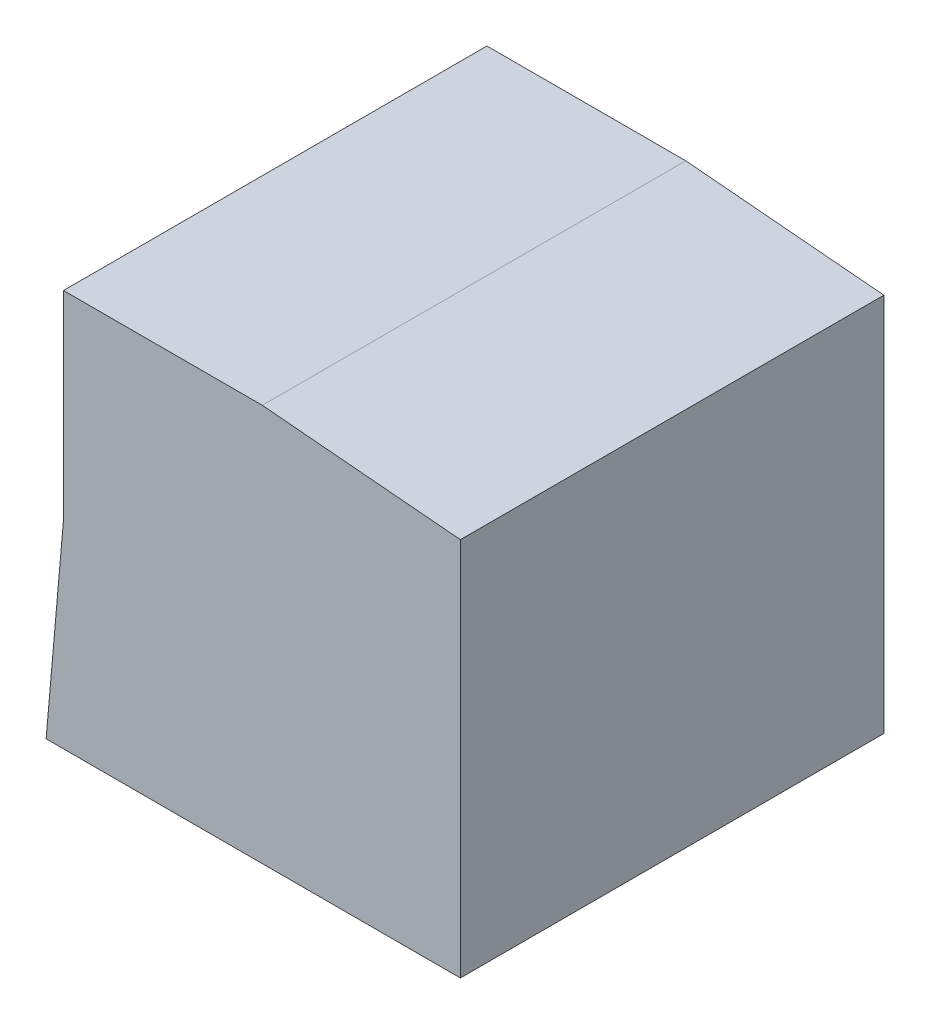
ISO-10303-21;
HEADER;
FILE_DESCRIPTION(('STEP AP214'),'2;1');
FILE_NAME('part.step','',(''),(''),'','','');
FILE_SCHEMA(('AUTOMOTIVE_DESIGN { 1 0 10303 214 1 1 1 1 }'));
ENDSEC;
DATA;
#1=APPLICATION_CONTEXT('core data for automotive mechanical design processes');
#2=APPLICATION_PROTOCOL_DEFINITION('international standard','automotive_design',2000,#1);
#3=PRODUCT_CONTEXT('',#1,'mechanical');
#4=PRODUCT('Part','Part','',(#3));
#5=PRODUCT_RELATED_PRODUCT_CATEGORY('part','',(#4));
#6=PRODUCT_DEFINITION_FORMATION('','',#4);
#7=PRODUCT_DEFINITION_CONTEXT('part definition',#1,'design');
#8=PRODUCT_DEFINITION('design','',#6,#7);
#9=PRODUCT_DEFINITION_SHAPE('','',#8);
#10=(LENGTH_UNIT() NAMED_UNIT(*) SI_UNIT(.MILLI.,.METRE.));
#11=(NAMED_UNIT(*) PLANE_ANGLE_UNIT() SI_UNIT($,.RADIAN.));
#12=(NAMED_UNIT(*) SI_UNIT($,.STERADIAN.) SOLID_ANGLE_UNIT());
#13=UNCERTAINTY_MEASURE_WITH_UNIT(LENGTH_MEASURE(1.E-05),#10,'distance_accuracy_value','');
#14=(GEOMETRIC_REPRESENTATION_CONTEXT(3) GLOBAL_UNCERTAINTY_ASSIGNED_CONTEXT((#13)) GLOBAL_UNIT_ASSIGNED_CONTEXT((#10,
#11,#12)) REPRESENTATION_CONTEXT('',''));
#15=CARTESIAN_POINT('',(0.,0.,0.));
#16=DIRECTION('',(0.,0.,1.));
#17=DIRECTION('',(1.,0.,0.));
#18=AXIS2_PLACEMENT_3D('',#15,#16,#17);
#19=CARTESIAN_POINT('',(0.,0.,40.));
#20=DIRECTION('',(1.,0.,0.));
#21=DIRECTION('',(0.,0.,-1.));
#22=AXIS2_PLACEMENT_3D('',#19,#20,#21);
#23=PLANE('',#22);
#24=DIRECTION('',(0.,-1.,0.));
#25=VECTOR('',#24,1.);
#26=CARTESIAN_POINT('',(0.,0.,0.));
#27=LINE('',#26,#25);
#28=CARTESIAN_POINT('',(0.,0.,0.));
#29=VERTEX_POINT('',#28);
#30=CARTESIAN_POINT('',(0.,-18.7818459466086,0.));
#31=VERTEX_POINT('',#30);
#32=EDGE_CURVE('E118',#29,#31,#27,.T.);
#33=ORIENTED_EDGE('',*,*,#32,.T.);
#34=DIRECTION('',(0.,0.,-1.));
#35=VECTOR('',#34,1.);
#36=CARTESIAN_POINT('',(0.,-18.7818459466086,40.));
#37=LINE('',#36,#35);
#38=CARTESIAN_POINT('',(0.,-18.7818459466086,40.));
#39=VERTEX_POINT('',#38);
#40=EDGE_CURVE('E11',#39,#31,#37,.T.);
#41=ORIENTED_EDGE('',*,*,#40,.F.);
#42=DIRECTION('',(0.,-1.,0.));
#43=VECTOR('',#42,1.);
#44=CARTESIAN_POINT('',(0.,0.,40.));
#45=LINE('',#44,#43);
#46=CARTESIAN_POINT('',(0.,0.,40.));
#47=VERTEX_POINT('',#46);
#48=EDGE_CURVE('E128',#47,#39,#45,.T.);
#49=ORIENTED_EDGE('',*,*,#48,.F.);
#50=DIRECTION('',(0.,0.,-1.));
#51=VECTOR('',#50,1.);
#52=CARTESIAN_POINT('',(0.,0.,40.));
#53=LINE('',#52,#51);
#54=EDGE_CURVE('E114',#47,#29,#53,.T.);
#55=ORIENTED_EDGE('',*,*,#54,.T.);
#56=EDGE_LOOP('',(#33,#41,#49,#55));
#57=FACE_BOUND('',#56,.T.);
#58=ADVANCED_FACE('F34',(#57),#23,.F.);
#59=CARTESIAN_POINT('',(0.,-18.7818459466086,40.));
#60=DIRECTION('',(0.996194698091746,-0.0871557427476581,0.));
#61=DIRECTION('',(0.0871557427476581,0.996194698091746,0.));
#62=AXIS2_PLACEMENT_3D('',#59,#60,#61);
#63=PLANE('',#62);
#64=DIRECTION('',(-0.0871557427476581,-0.996194698091745,0.));
#65=VECTOR('',#64,1.);
#66=CARTESIAN_POINT('',(0.,-18.7818459466086,0.));
#67=LINE('',#66,#65);
#68=CARTESIAN_POINT('',(-1.63694573364877,-37.4922212989961,0.));
#69=VERTEX_POINT('',#68);
#70=EDGE_CURVE('E121',#31,#69,#67,.T.);
#71=ORIENTED_EDGE('',*,*,#70,.T.);
#72=DIRECTION('',(0.,0.,-1.));
#73=VECTOR('',#72,1.);
#74=CARTESIAN_POINT('',(-1.63694573364877,-37.4922212989961,40.));
#75=LINE('',#74,#73);
#76=CARTESIAN_POINT('',(-1.63694573364877,-37.4922212989961,40.));
#77=VERTEX_POINT('',#76);
#78=EDGE_CURVE('E42',#77,#69,#75,.T.);
#79=ORIENTED_EDGE('',*,*,#78,.F.);
#80=DIRECTION('',(-0.0871557427476581,-0.996194698091745,0.));
#81=VECTOR('',#80,1.);
#82=CARTESIAN_POINT('',(0.,-18.7818459466086,40.));
#83=LINE('',#82,#81);
#84=EDGE_CURVE('E87',#39,#77,#83,.T.);
#85=ORIENTED_EDGE('',*,*,#84,.F.);
#86=ORIENTED_EDGE('',*,*,#40,.T.);
#87=EDGE_LOOP('',(#71,#79,#85,#86));
#88=FACE_BOUND('',#87,.T.);
#89=ADVANCED_FACE('F152',(#88),#63,.F.);
#90=CARTESIAN_POINT('',(-1.63694573364877,-37.4922212989961,40.));
#91=DIRECTION('',(0.,1.,0.));
#92=DIRECTION('',(0.,0.,1.));
#93=AXIS2_PLACEMENT_3D('',#90,#91,#92);
#94=PLANE('',#93);
#95=DIRECTION('',(1.,0.,0.));
#96=VECTOR('',#95,1.);
#97=CARTESIAN_POINT('',(-1.63694573364877,-37.4922212989961,0.));
#98=LINE('',#97,#96);
#99=CARTESIAN_POINT('',(37.4922212989961,-37.4922212989961,0.));
#100=VERTEX_POINT('',#99);
#101=EDGE_CURVE('E123',#69,#100,#98,.T.);
#102=ORIENTED_EDGE('',*,*,#101,.T.);
#103=DIRECTION('',(0.,0.,-1.));
#104=VECTOR('',#103,1.);
#105=CARTESIAN_POINT('',(37.4922212989961,-37.4922212989961,40.));
#106=LINE('',#105,#104);
#107=CARTESIAN_POINT('',(37.4922212989961,-37.4922212989961,40.));
#108=VERTEX_POINT('',#107);
#109=EDGE_CURVE('E109',#108,#100,#106,.T.);
#110=ORIENTED_EDGE('',*,*,#109,.F.);
#111=DIRECTION('',(1.,0.,0.));
#112=VECTOR('',#111,1.);
#113=CARTESIAN_POINT('',(-1.63694573364877,-37.4922212989961,40.));
#114=LINE('',#113,#112);
#115=EDGE_CURVE('E100',#77,#108,#114,.T.);
#116=ORIENTED_EDGE('',*,*,#115,.F.);
#117=ORIENTED_EDGE('',*,*,#78,.T.);
#118=EDGE_LOOP('',(#102,#110,#116,#117));
#119=FACE_BOUND('',#118,.T.);
#120=ADVANCED_FACE('F134',(#119),#94,.F.);
#121=CARTESIAN_POINT('',(37.4922212989961,-1.63694573364877,40.));
#122=DIRECTION('',(-1.,0.,0.));
#123=DIRECTION('',(0.,-1.,0.));
#124=AXIS2_PLACEMENT_3D('',#121,#122,#123);
#125=PLANE('',#124);
#126=DIRECTION('',(0.,1.,0.));
#127=VECTOR('',#126,1.);
#128=CARTESIAN_POINT('',(37.4922212989961,-1.63694573364877,0.));
#129=LINE('',#128,#127);
#130=CARTESIAN_POINT('',(37.4922212989961,-1.63694573364877,0.));
#131=VERTEX_POINT('',#130);
#132=EDGE_CURVE('E108',#100,#131,#129,.T.);
#133=ORIENTED_EDGE('',*,*,#132,.T.);
#134=DIRECTION('',(0.,0.,-1.));
#135=VECTOR('',#134,1.);
#136=CARTESIAN_POINT('',(37.4922212989961,-1.63694573364877,40.));
#137=LINE('',#136,#135);
#138=CARTESIAN_POINT('',(37.4922212989961,-1.63694573364877,40.));
#139=VERTEX_POINT('',#138);
#140=EDGE_CURVE('E105',#139,#131,#137,.T.);
#141=ORIENTED_EDGE('',*,*,#140,.F.);
#142=DIRECTION('',(0.,1.,0.));
#143=VECTOR('',#142,1.);
#144=CARTESIAN_POINT('',(37.4922212989961,-1.63694573364877,40.));
#145=LINE('',#144,#143);
#146=EDGE_CURVE('E94',#108,#139,#145,.T.);
#147=ORIENTED_EDGE('',*,*,#146,.F.);
#148=ORIENTED_EDGE('',*,*,#109,.T.);
#149=EDGE_LOOP('',(#133,#141,#147,#148));
#150=FACE_BOUND('',#149,.T.);
#151=ADVANCED_FACE('F106',(#150),#125,.F.);
#152=CARTESIAN_POINT('',(18.7818459466086,0.,40.));
#153=DIRECTION('',(-0.0871557427476584,-0.996194698091746,0.));
#154=DIRECTION('',(0.996194698091746,-0.0871557427476584,0.));
#155=AXIS2_PLACEMENT_3D('',#152,#153,#154);
#156=PLANE('',#155);
#157=DIRECTION('',(-0.996194698091745,0.0871557427476584,0.));
#158=VECTOR('',#157,1.);
#159=CARTESIAN_POINT('',(18.7818459466086,0.,0.));
#160=LINE('',#159,#158);
#161=CARTESIAN_POINT('',(18.7818459466086,0.,0.));
#162=VERTEX_POINT('',#161);
#163=EDGE_CURVE('E73',#131,#162,#160,.T.);
#164=ORIENTED_EDGE('',*,*,#163,.T.);
#165=DIRECTION('',(0.,0.,-1.));
#166=VECTOR('',#165,1.);
#167=CARTESIAN_POINT('',(18.7818459466086,0.,40.));
#168=LINE('',#167,#166);
#169=CARTESIAN_POINT('',(18.7818459466086,0.,40.));
#170=VERTEX_POINT('',#169);
#171=EDGE_CURVE('E110',#170,#162,#168,.T.);
#172=ORIENTED_EDGE('',*,*,#171,.F.);
#173=DIRECTION('',(-0.996194698091745,0.0871557427476584,0.));
#174=VECTOR('',#173,1.);
#175=CARTESIAN_POINT('',(18.7818459466086,0.,40.));
#176=LINE('',#175,#174);
#177=EDGE_CURVE('E98',#139,#170,#176,.T.);
#178=ORIENTED_EDGE('',*,*,#177,.F.);
#179=ORIENTED_EDGE('',*,*,#140,.T.);
#180=EDGE_LOOP('',(#164,#172,#178,#179));
#181=FACE_BOUND('',#180,.T.);
#182=ADVANCED_FACE('F112',(#181),#156,.F.);
#183=CARTESIAN_POINT('',(0.,0.,40.));
#184=DIRECTION('',(0.,-1.,0.));
#185=DIRECTION('',(0.,0.,-1.));
#186=AXIS2_PLACEMENT_3D('',#183,#184,#185);
#187=PLANE('',#186);
#188=DIRECTION('',(-1.,0.,0.));
#189=VECTOR('',#188,1.);
#190=CARTESIAN_POINT('',(0.,0.,0.));
#191=LINE('',#190,#189);
#192=EDGE_CURVE('E79',#162,#29,#191,.T.);
#193=ORIENTED_EDGE('',*,*,#192,.T.);
#194=ORIENTED_EDGE('',*,*,#54,.F.);
#195=DIRECTION('',(-1.,0.,0.));
#196=VECTOR('',#195,1.);
#197=CARTESIAN_POINT('',(0.,0.,40.));
#198=LINE('',#197,#196);
#199=EDGE_CURVE('E50',#170,#47,#198,.T.);
#200=ORIENTED_EDGE('',*,*,#199,.F.);
#201=ORIENTED_EDGE('',*,*,#171,.T.);
#202=EDGE_LOOP('',(#193,#194,#200,#201));
#203=FACE_BOUND('',#202,.T.);
#204=ADVANCED_FACE('F141',(#203),#187,.F.);
#205=CARTESIAN_POINT('',(0.,0.,40.));
#206=DIRECTION('',(0.,0.,1.));
#207=DIRECTION('',(1.,0.,0.));
#208=AXIS2_PLACEMENT_3D('',#205,#206,#207);
#209=PLANE('',#208);
#210=ORIENTED_EDGE('',*,*,#48,.T.);
#211=ORIENTED_EDGE('',*,*,#84,.T.);
#212=ORIENTED_EDGE('',*,*,#115,.T.);
#213=ORIENTED_EDGE('',*,*,#146,.T.);
#214=ORIENTED_EDGE('',*,*,#177,.T.);
#215=ORIENTED_EDGE('',*,*,#199,.T.);
#216=EDGE_LOOP('',(#210,#211,#212,#213,#214,#215));
#217=FACE_BOUND('',#216,.T.);
#218=ADVANCED_FACE('F96',(#217),#209,.T.);
#219=CARTESIAN_POINT('',(0.,0.,0.));
#220=DIRECTION('',(0.,0.,1.));
#221=DIRECTION('',(1.,0.,0.));
#222=AXIS2_PLACEMENT_3D('',#219,#220,#221);
#223=PLANE('',#222);
#224=ORIENTED_EDGE('',*,*,#32,.F.);
#225=ORIENTED_EDGE('',*,*,#192,.F.);
#226=ORIENTED_EDGE('',*,*,#163,.F.);
#227=ORIENTED_EDGE('',*,*,#132,.F.);
#228=ORIENTED_EDGE('',*,*,#101,.F.);
#229=ORIENTED_EDGE('',*,*,#70,.F.);
#230=EDGE_LOOP('',(#224,#225,#226,#227,#228,#229));
#231=FACE_BOUND('',#230,.T.);
#232=ADVANCED_FACE('F137',(#231),#223,.F.);
#233=CLOSED_SHELL('',(#58,#89,#120,#151,#182,#204,#218,#232));
#234=MANIFOLD_SOLID_BREP('B2',#233);
#235=ADVANCED_BREP_SHAPE_REPRESENTATION('',(#18,#234),#14);
#236=SHAPE_DEFINITION_REPRESENTATION(#9,#235);
ENDSEC;
END-ISO-10303-21;
